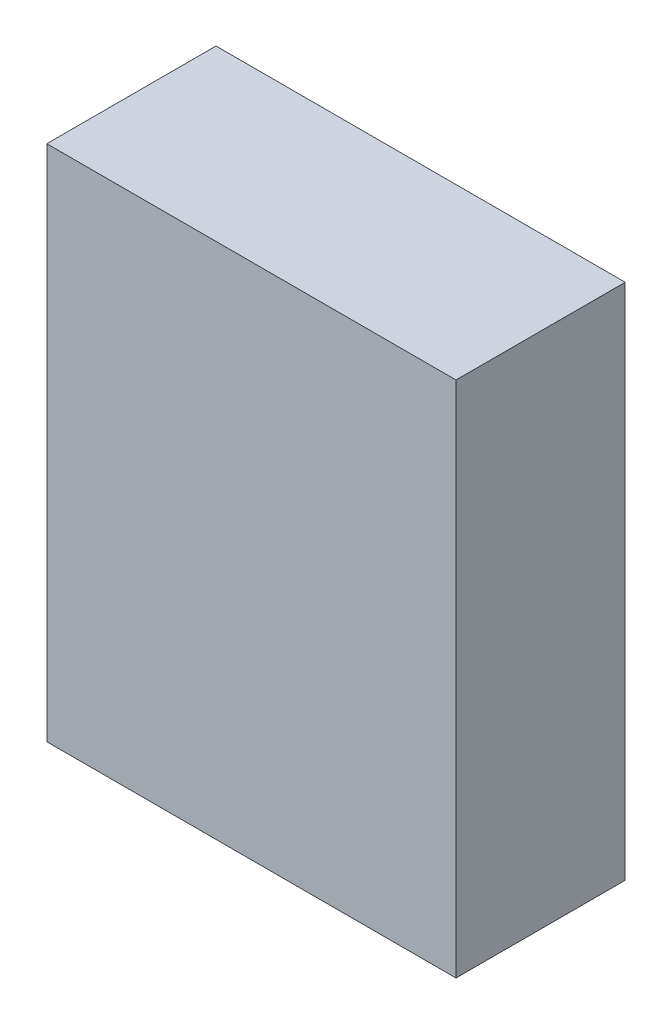
ISO-10303-21;
HEADER;
FILE_DESCRIPTION(('STEP AP214'),'2;1');
FILE_NAME('part.step','',(''),(''),'','','');
FILE_SCHEMA(('AUTOMOTIVE_DESIGN { 1 0 10303 214 1 1 1 1 }'));
ENDSEC;
DATA;
#1=APPLICATION_CONTEXT('core data for automotive mechanical design processes');
#2=APPLICATION_PROTOCOL_DEFINITION('international standard','automotive_design',2000,#1);
#3=PRODUCT_CONTEXT('',#1,'mechanical');
#4=PRODUCT('Part','Part','',(#3));
#5=PRODUCT_RELATED_PRODUCT_CATEGORY('part','',(#4));
#6=PRODUCT_DEFINITION_FORMATION('','',#4);
#7=PRODUCT_DEFINITION_CONTEXT('part definition',#1,'design');
#8=PRODUCT_DEFINITION('design','',#6,#7);
#9=PRODUCT_DEFINITION_SHAPE('','',#8);
#10=(LENGTH_UNIT() NAMED_UNIT(*) SI_UNIT(.MILLI.,.METRE.));
#11=(NAMED_UNIT(*) PLANE_ANGLE_UNIT() SI_UNIT($,.RADIAN.));
#12=(NAMED_UNIT(*) SI_UNIT($,.STERADIAN.) SOLID_ANGLE_UNIT());
#13=UNCERTAINTY_MEASURE_WITH_UNIT(LENGTH_MEASURE(1.E-05),#10,'distance_accuracy_value','');
#14=(GEOMETRIC_REPRESENTATION_CONTEXT(3) GLOBAL_UNCERTAINTY_ASSIGNED_CONTEXT((#13)) GLOBAL_UNIT_ASSIGNED_CONTEXT((#10,
#11,#12)) REPRESENTATION_CONTEXT('',''));
#15=CARTESIAN_POINT('',(0.,0.,0.));
#16=DIRECTION('',(0.,0.,1.));
#17=DIRECTION('',(1.,0.,0.));
#18=AXIS2_PLACEMENT_3D('',#15,#16,#17);
#19=CARTESIAN_POINT('',(-1.99499982,-2.52499876,1.64999924));
#20=DIRECTION('',(0.,0.,1.));
#21=DIRECTION('',(1.,0.,0.));
#22=AXIS2_PLACEMENT_3D('',#19,#20,#21);
#23=PLANE('',#22);
#24=DIRECTION('',(1.,0.,0.));
#25=VECTOR('',#24,1.);
#26=CARTESIAN_POINT('',(-1.99499982,2.52499876,1.64999924));
#27=LINE('',#26,#25);
#28=CARTESIAN_POINT('',(-1.99499982,2.52499876,1.64999924));
#29=VERTEX_POINT('',#28);
#30=CARTESIAN_POINT('',(1.99499982,2.52499876,1.64999924));
#31=VERTEX_POINT('',#30);
#32=EDGE_CURVE('E53',#29,#31,#27,.T.);
#33=ORIENTED_EDGE('',*,*,#32,.F.);
#34=DIRECTION('',(0.,1.,0.));
#35=VECTOR('',#34,1.);
#36=CARTESIAN_POINT('',(-1.99499982,-2.52499876,1.64999924));
#37=LINE('',#36,#35);
#38=CARTESIAN_POINT('',(-1.99499982,-2.52499876,1.64999924));
#39=VERTEX_POINT('',#38);
#40=EDGE_CURVE('E68',#39,#29,#37,.T.);
#41=ORIENTED_EDGE('',*,*,#40,.F.);
#42=DIRECTION('',(1.,0.,0.));
#43=VECTOR('',#42,1.);
#44=CARTESIAN_POINT('',(1.99499982,-2.52499876,1.64999924));
#45=LINE('',#44,#43);
#46=CARTESIAN_POINT('',(1.99499982,-2.52499876,1.64999924));
#47=VERTEX_POINT('',#46);
#48=EDGE_CURVE('E20',#47,#39,#45,.F.);
#49=ORIENTED_EDGE('',*,*,#48,.F.);
#50=DIRECTION('',(0.,1.,0.));
#51=VECTOR('',#50,1.);
#52=CARTESIAN_POINT('',(1.99499982,2.52499876,1.64999924));
#53=LINE('',#52,#51);
#54=EDGE_CURVE('E58',#31,#47,#53,.F.);
#55=ORIENTED_EDGE('',*,*,#54,.F.);
#56=EDGE_LOOP('',(#33,#41,#49,#55));
#57=FACE_BOUND('',#56,.T.);
#58=ADVANCED_FACE('F17',(#57),#23,.T.);
#59=CARTESIAN_POINT('',(1.99499982,-2.52499876,0.));
#60=DIRECTION('',(0.,-1.,0.));
#61=DIRECTION('',(0.,0.,-1.));
#62=AXIS2_PLACEMENT_3D('',#59,#60,#61);
#63=PLANE('',#62);
#64=DIRECTION('',(0.,0.,1.));
#65=VECTOR('',#64,1.);
#66=CARTESIAN_POINT('',(-1.99499982,-2.52499876,0.));
#67=LINE('',#66,#65);
#68=CARTESIAN_POINT('',(-1.99499982,-2.52499876,0.));
#69=VERTEX_POINT('',#68);
#70=EDGE_CURVE('E79',#69,#39,#67,.T.);
#71=ORIENTED_EDGE('',*,*,#70,.F.);
#72=DIRECTION('',(1.,0.,0.));
#73=VECTOR('',#72,1.);
#74=CARTESIAN_POINT('',(-1.99499982,-2.52499876,0.));
#75=LINE('',#74,#73);
#76=CARTESIAN_POINT('',(1.99499982,-2.52499876,0.));
#77=VERTEX_POINT('',#76);
#78=EDGE_CURVE('E74',#69,#77,#75,.T.);
#79=ORIENTED_EDGE('',*,*,#78,.T.);
#80=DIRECTION('',(0.,0.,-1.));
#81=VECTOR('',#80,1.);
#82=CARTESIAN_POINT('',(1.99499982,-2.52499876,0.));
#83=LINE('',#82,#81);
#84=EDGE_CURVE('E63',#47,#77,#83,.T.);
#85=ORIENTED_EDGE('',*,*,#84,.F.);
#86=ORIENTED_EDGE('',*,*,#48,.T.);
#87=EDGE_LOOP('',(#71,#79,#85,#86));
#88=FACE_BOUND('',#87,.T.);
#89=ADVANCED_FACE('F73',(#88),#63,.T.);
#90=CARTESIAN_POINT('',(1.99499982,2.52499876,0.));
#91=DIRECTION('',(1.,0.,0.));
#92=DIRECTION('',(0.,0.,-1.));
#93=AXIS2_PLACEMENT_3D('',#90,#91,#92);
#94=PLANE('',#93);
#95=ORIENTED_EDGE('',*,*,#84,.T.);
#96=DIRECTION('',(0.,1.,0.));
#97=VECTOR('',#96,1.);
#98=CARTESIAN_POINT('',(1.99499982,-2.52499876,0.));
#99=LINE('',#98,#97);
#100=CARTESIAN_POINT('',(1.99499982,2.52499876,0.));
#101=VERTEX_POINT('',#100);
#102=EDGE_CURVE('E84',#77,#101,#99,.T.);
#103=ORIENTED_EDGE('',*,*,#102,.T.);
#104=DIRECTION('',(0.,0.,1.));
#105=VECTOR('',#104,1.);
#106=CARTESIAN_POINT('',(1.99499982,2.52499876,0.));
#107=LINE('',#106,#105);
#108=EDGE_CURVE('E65',#31,#101,#107,.F.);
#109=ORIENTED_EDGE('',*,*,#108,.F.);
#110=ORIENTED_EDGE('',*,*,#54,.T.);
#111=EDGE_LOOP('',(#95,#103,#109,#110));
#112=FACE_BOUND('',#111,.T.);
#113=ADVANCED_FACE('F60',(#112),#94,.T.);
#114=CARTESIAN_POINT('',(-1.99499982,2.52499876,0.));
#115=DIRECTION('',(0.,1.,0.));
#116=DIRECTION('',(0.,0.,1.));
#117=AXIS2_PLACEMENT_3D('',#114,#115,#116);
#118=PLANE('',#117);
#119=ORIENTED_EDGE('',*,*,#108,.T.);
#120=DIRECTION('',(1.,0.,0.));
#121=VECTOR('',#120,1.);
#122=CARTESIAN_POINT('',(-1.99499982,2.52499876,0.));
#123=LINE('',#122,#121);
#124=CARTESIAN_POINT('',(-1.99499982,2.52499876,0.));
#125=VERTEX_POINT('',#124);
#126=EDGE_CURVE('E26',#101,#125,#123,.F.);
#127=ORIENTED_EDGE('',*,*,#126,.T.);
#128=DIRECTION('',(0.,0.,1.));
#129=VECTOR('',#128,1.);
#130=CARTESIAN_POINT('',(-1.99499982,2.52499876,0.));
#131=LINE('',#130,#129);
#132=EDGE_CURVE('E34',#29,#125,#131,.F.);
#133=ORIENTED_EDGE('',*,*,#132,.F.);
#134=ORIENTED_EDGE('',*,*,#32,.T.);
#135=EDGE_LOOP('',(#119,#127,#133,#134));
#136=FACE_BOUND('',#135,.T.);
#137=ADVANCED_FACE('F88',(#136),#118,.T.);
#138=CARTESIAN_POINT('',(-1.99499982,-2.52499876,0.));
#139=DIRECTION('',(-1.,0.,0.));
#140=DIRECTION('',(0.,0.,1.));
#141=AXIS2_PLACEMENT_3D('',#138,#139,#140);
#142=PLANE('',#141);
#143=ORIENTED_EDGE('',*,*,#132,.T.);
#144=DIRECTION('',(0.,1.,0.));
#145=VECTOR('',#144,1.);
#146=CARTESIAN_POINT('',(-1.99499982,-2.52499876,0.));
#147=LINE('',#146,#145);
#148=EDGE_CURVE('E11',#125,#69,#147,.F.);
#149=ORIENTED_EDGE('',*,*,#148,.T.);
#150=ORIENTED_EDGE('',*,*,#70,.T.);
#151=ORIENTED_EDGE('',*,*,#40,.T.);
#152=EDGE_LOOP('',(#143,#149,#150,#151));
#153=FACE_BOUND('',#152,.T.);
#154=ADVANCED_FACE('F91',(#153),#142,.T.);
#155=CARTESIAN_POINT('',(-1.99499982,-2.52499876,0.));
#156=DIRECTION('',(0.,0.,1.));
#157=DIRECTION('',(1.,0.,0.));
#158=AXIS2_PLACEMENT_3D('',#155,#156,#157);
#159=PLANE('',#158);
#160=ORIENTED_EDGE('',*,*,#126,.F.);
#161=ORIENTED_EDGE('',*,*,#102,.F.);
#162=ORIENTED_EDGE('',*,*,#78,.F.);
#163=ORIENTED_EDGE('',*,*,#148,.F.);
#164=EDGE_LOOP('',(#160,#161,#162,#163));
#165=FACE_BOUND('',#164,.T.);
#166=ADVANCED_FACE('F90',(#165),#159,.F.);
#167=CLOSED_SHELL('',(#58,#89,#113,#137,#154,#166));
#168=MANIFOLD_SOLID_BREP('B1',#167);
#169=ADVANCED_BREP_SHAPE_REPRESENTATION('',(#18,#168),#14);
#170=SHAPE_DEFINITION_REPRESENTATION(#9,#169);
ENDSEC;
END-ISO-10303-21;
